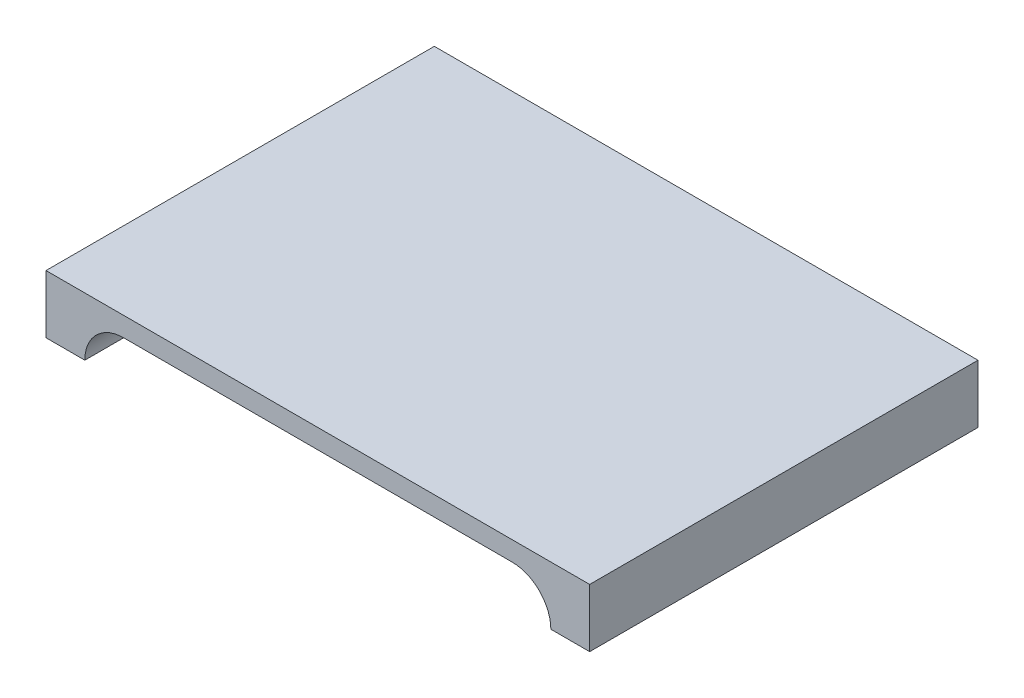
ISO-10303-21;
HEADER;
FILE_DESCRIPTION(('STEP AP214'),'2;1');
FILE_NAME('part.step','',(''),(''),'','','');
FILE_SCHEMA(('AUTOMOTIVE_DESIGN { 1 0 10303 214 1 1 1 1 }'));
ENDSEC;
DATA;
#1=APPLICATION_CONTEXT('core data for automotive mechanical design processes');
#2=APPLICATION_PROTOCOL_DEFINITION('international standard','automotive_design',2000,#1);
#3=PRODUCT_CONTEXT('',#1,'mechanical');
#4=PRODUCT('Part','Part','',(#3));
#5=PRODUCT_RELATED_PRODUCT_CATEGORY('part','',(#4));
#6=PRODUCT_DEFINITION_FORMATION('','',#4);
#7=PRODUCT_DEFINITION_CONTEXT('part definition',#1,'design');
#8=PRODUCT_DEFINITION('design','',#6,#7);
#9=PRODUCT_DEFINITION_SHAPE('','',#8);
#10=(LENGTH_UNIT() NAMED_UNIT(*) SI_UNIT(.MILLI.,.METRE.));
#11=(NAMED_UNIT(*) PLANE_ANGLE_UNIT() SI_UNIT($,.RADIAN.));
#12=(NAMED_UNIT(*) SI_UNIT($,.STERADIAN.) SOLID_ANGLE_UNIT());
#13=UNCERTAINTY_MEASURE_WITH_UNIT(LENGTH_MEASURE(1.E-05),#10,'distance_accuracy_value','');
#14=(GEOMETRIC_REPRESENTATION_CONTEXT(3) GLOBAL_UNCERTAINTY_ASSIGNED_CONTEXT((#13)) GLOBAL_UNIT_ASSIGNED_CONTEXT((#10,
#11,#12)) REPRESENTATION_CONTEXT('',''));
#15=CARTESIAN_POINT('',(0.,0.,0.));
#16=DIRECTION('',(0.,0.,1.));
#17=DIRECTION('',(1.,0.,0.));
#18=AXIS2_PLACEMENT_3D('',#15,#16,#17);
#19=CARTESIAN_POINT('',(0.,25.4,0.));
#20=DIRECTION('',(0.,-1.,0.));
#21=DIRECTION('',(0.,0.,-1.));
#22=AXIS2_PLACEMENT_3D('',#19,#20,#21);
#23=PLANE('',#22);
#24=DIRECTION('',(0.,0.,1.));
#25=VECTOR('',#24,1.);
#26=CARTESIAN_POINT('',(355.6,25.4,0.));
#27=LINE('',#26,#25);
#28=CARTESIAN_POINT('',(355.6,25.4,-25.4));
#29=VERTEX_POINT('',#28);
#30=CARTESIAN_POINT('',(355.6,25.4,482.6));
#31=VERTEX_POINT('',#30);
#32=EDGE_CURVE('E162',#29,#31,#27,.T.);
#33=ORIENTED_EDGE('',*,*,#32,.F.);
#34=DIRECTION('',(1.,0.,0.));
#35=VECTOR('',#34,1.);
#36=CARTESIAN_POINT('',(-355.6,25.4,-25.4));
#37=LINE('',#36,#35);
#38=CARTESIAN_POINT('',(-355.6,25.4,-25.4));
#39=VERTEX_POINT('',#38);
#40=EDGE_CURVE('E130',#39,#29,#37,.T.);
#41=ORIENTED_EDGE('',*,*,#40,.F.);
#42=DIRECTION('',(0.,0.,-1.));
#43=VECTOR('',#42,1.);
#44=CARTESIAN_POINT('',(-355.6,25.4,457.2));
#45=LINE('',#44,#43);
#46=CARTESIAN_POINT('',(-355.6,25.4,482.6));
#47=VERTEX_POINT('',#46);
#48=EDGE_CURVE('E158',#47,#39,#45,.T.);
#49=ORIENTED_EDGE('',*,*,#48,.F.);
#50=DIRECTION('',(-1.,0.,0.));
#51=VECTOR('',#50,1.);
#52=CARTESIAN_POINT('',(0.,25.4,482.6));
#53=LINE('',#52,#51);
#54=EDGE_CURVE('E139',#31,#47,#53,.T.);
#55=ORIENTED_EDGE('',*,*,#54,.F.);
#56=EDGE_LOOP('',(#33,#41,#49,#55));
#57=FACE_BOUND('',#56,.T.);
#58=ADVANCED_FACE('F37',(#57),#23,.F.);
#59=CARTESIAN_POINT('',(-254.,-50.8,457.2));
#60=DIRECTION('',(0.,0.,-1.));
#61=DIRECTION('',(-1.,0.,0.));
#62=AXIS2_PLACEMENT_3D('',#59,#60,#61);
#63=CYLINDRICAL_SURFACE('',#62,50.8);
#64=DIRECTION('',(0.,0.,-1.));
#65=VECTOR('',#64,1.);
#66=CARTESIAN_POINT('',(-304.8,-50.8,457.2));
#67=LINE('',#66,#65);
#68=CARTESIAN_POINT('',(-304.8,-50.8,-25.4));
#69=VERTEX_POINT('',#68);
#70=CARTESIAN_POINT('',(-304.8,-50.8,482.6));
#71=VERTEX_POINT('',#70);
#72=EDGE_CURVE('E40',#69,#71,#67,.F.);
#73=ORIENTED_EDGE('',*,*,#72,.F.);
#74=CARTESIAN_POINT('',(-254.,-50.8,-25.4));
#75=DIRECTION('',(0.,0.,1.));
#76=DIRECTION('',(-1.,0.,0.));
#77=AXIS2_PLACEMENT_3D('',#74,#75,#76);
#78=CIRCLE('',#77,50.8);
#79=CARTESIAN_POINT('',(-254.,0.,-25.4));
#80=VERTEX_POINT('',#79);
#81=EDGE_CURVE('E115',#80,#69,#78,.T.);
#82=ORIENTED_EDGE('',*,*,#81,.F.);
#83=DIRECTION('',(0.,0.,-1.));
#84=VECTOR('',#83,1.);
#85=CARTESIAN_POINT('',(-254.,0.,457.2));
#86=LINE('',#85,#84);
#87=CARTESIAN_POINT('',(-254.,0.,482.6));
#88=VERTEX_POINT('',#87);
#89=EDGE_CURVE('E45',#88,#80,#86,.T.);
#90=ORIENTED_EDGE('',*,*,#89,.F.);
#91=CARTESIAN_POINT('',(-254.,-50.8,482.6));
#92=DIRECTION('',(0.,0.,1.));
#93=DIRECTION('',(1.,0.,0.));
#94=AXIS2_PLACEMENT_3D('',#91,#92,#93);
#95=CIRCLE('',#94,50.8);
#96=EDGE_CURVE('E149',#71,#88,#95,.F.);
#97=ORIENTED_EDGE('',*,*,#96,.F.);
#98=EDGE_LOOP('',(#73,#82,#90,#97));
#99=FACE_BOUND('',#98,.T.);
#100=ADVANCED_FACE('F174',(#99),#63,.F.);
#101=CARTESIAN_POINT('',(0.,0.,457.2));
#102=DIRECTION('',(0.,1.,0.));
#103=DIRECTION('',(0.,0.,1.));
#104=AXIS2_PLACEMENT_3D('',#101,#102,#103);
#105=PLANE('',#104);
#106=ORIENTED_EDGE('',*,*,#89,.T.);
#107=DIRECTION('',(-1.,0.,0.));
#108=VECTOR('',#107,1.);
#109=CARTESIAN_POINT('',(254.,0.,-25.4));
#110=LINE('',#109,#108);
#111=CARTESIAN_POINT('',(254.,0.,-25.4));
#112=VERTEX_POINT('',#111);
#113=EDGE_CURVE('E110',#112,#80,#110,.T.);
#114=ORIENTED_EDGE('',*,*,#113,.F.);
#115=DIRECTION('',(0.,0.,-1.));
#116=VECTOR('',#115,1.);
#117=CARTESIAN_POINT('',(254.,0.,457.2));
#118=LINE('',#117,#116);
#119=CARTESIAN_POINT('',(254.,0.,482.6));
#120=VERTEX_POINT('',#119);
#121=EDGE_CURVE('E11',#120,#112,#118,.T.);
#122=ORIENTED_EDGE('',*,*,#121,.F.);
#123=DIRECTION('',(1.,0.,0.));
#124=VECTOR('',#123,1.);
#125=CARTESIAN_POINT('',(0.,0.,482.6));
#126=LINE('',#125,#124);
#127=EDGE_CURVE('E152',#88,#120,#126,.T.);
#128=ORIENTED_EDGE('',*,*,#127,.F.);
#129=EDGE_LOOP('',(#106,#114,#122,#128));
#130=FACE_BOUND('',#129,.T.);
#131=ADVANCED_FACE('F111',(#130),#105,.F.);
#132=CARTESIAN_POINT('',(254.,-50.8,457.2));
#133=DIRECTION('',(0.,0.,-1.));
#134=DIRECTION('',(-1.,0.,0.));
#135=AXIS2_PLACEMENT_3D('',#132,#133,#134);
#136=CYLINDRICAL_SURFACE('',#135,50.8);
#137=ORIENTED_EDGE('',*,*,#121,.T.);
#138=CARTESIAN_POINT('',(254.,-50.8,-25.4));
#139=DIRECTION('',(0.,0.,1.));
#140=DIRECTION('',(-1.,0.,0.));
#141=AXIS2_PLACEMENT_3D('',#138,#139,#140);
#142=CIRCLE('',#141,50.8);
#143=CARTESIAN_POINT('',(304.8,-50.8,-25.4));
#144=VERTEX_POINT('',#143);
#145=EDGE_CURVE('E104',#144,#112,#142,.T.);
#146=ORIENTED_EDGE('',*,*,#145,.F.);
#147=DIRECTION('',(0.,0.,-1.));
#148=VECTOR('',#147,1.);
#149=CARTESIAN_POINT('',(304.8,-50.8,457.2));
#150=LINE('',#149,#148);
#151=CARTESIAN_POINT('',(304.8,-50.8,482.6));
#152=VERTEX_POINT('',#151);
#153=EDGE_CURVE('E61',#152,#144,#150,.T.);
#154=ORIENTED_EDGE('',*,*,#153,.F.);
#155=CARTESIAN_POINT('',(254.,-50.8,482.6));
#156=DIRECTION('',(0.,0.,1.));
#157=DIRECTION('',(1.,0.,0.));
#158=AXIS2_PLACEMENT_3D('',#155,#156,#157);
#159=CIRCLE('',#158,50.8);
#160=EDGE_CURVE('E105',#120,#152,#159,.F.);
#161=ORIENTED_EDGE('',*,*,#160,.F.);
#162=EDGE_LOOP('',(#137,#146,#154,#161));
#163=FACE_BOUND('',#162,.T.);
#164=ADVANCED_FACE('F102',(#163),#136,.F.);
#165=CARTESIAN_POINT('',(355.6,-50.8,457.2));
#166=DIRECTION('',(0.,1.,0.));
#167=DIRECTION('',(0.,0.,1.));
#168=AXIS2_PLACEMENT_3D('',#165,#166,#167);
#169=PLANE('',#168);
#170=ORIENTED_EDGE('',*,*,#153,.T.);
#171=DIRECTION('',(-1.,0.,0.));
#172=VECTOR('',#171,1.);
#173=CARTESIAN_POINT('',(355.6,-50.8,-25.4));
#174=LINE('',#173,#172);
#175=CARTESIAN_POINT('',(355.6,-50.8,-25.4));
#176=VERTEX_POINT('',#175);
#177=EDGE_CURVE('E120',#176,#144,#174,.T.);
#178=ORIENTED_EDGE('',*,*,#177,.F.);
#179=DIRECTION('',(0.,0.,-1.));
#180=VECTOR('',#179,1.);
#181=CARTESIAN_POINT('',(355.6,-50.8,457.2));
#182=LINE('',#181,#180);
#183=CARTESIAN_POINT('',(355.6,-50.8,482.6));
#184=VERTEX_POINT('',#183);
#185=EDGE_CURVE('E53',#184,#176,#182,.T.);
#186=ORIENTED_EDGE('',*,*,#185,.F.);
#187=DIRECTION('',(1.,0.,0.));
#188=VECTOR('',#187,1.);
#189=CARTESIAN_POINT('',(0.,-50.8,482.6));
#190=LINE('',#189,#188);
#191=EDGE_CURVE('E156',#152,#184,#190,.T.);
#192=ORIENTED_EDGE('',*,*,#191,.F.);
#193=EDGE_LOOP('',(#170,#178,#186,#192));
#194=FACE_BOUND('',#193,.T.);
#195=ADVANCED_FACE('F185',(#194),#169,.F.);
#196=CARTESIAN_POINT('',(355.6,0.,0.));
#197=DIRECTION('',(1.,0.,0.));
#198=DIRECTION('',(0.,0.,-1.));
#199=AXIS2_PLACEMENT_3D('',#196,#197,#198);
#200=PLANE('',#199);
#201=ORIENTED_EDGE('',*,*,#32,.T.);
#202=DIRECTION('',(0.,1.,0.));
#203=VECTOR('',#202,1.);
#204=CARTESIAN_POINT('',(355.6,0.,482.6));
#205=LINE('',#204,#203);
#206=EDGE_CURVE('E136',#184,#31,#205,.T.);
#207=ORIENTED_EDGE('',*,*,#206,.F.);
#208=ORIENTED_EDGE('',*,*,#185,.T.);
#209=DIRECTION('',(0.,-1.,0.));
#210=VECTOR('',#209,1.);
#211=CARTESIAN_POINT('',(355.6,25.4,-25.4));
#212=LINE('',#211,#210);
#213=EDGE_CURVE('E133',#29,#176,#212,.T.);
#214=ORIENTED_EDGE('',*,*,#213,.F.);
#215=EDGE_LOOP('',(#201,#207,#208,#214));
#216=FACE_BOUND('',#215,.T.);
#217=ADVANCED_FACE('F183',(#216),#200,.T.);
#218=CARTESIAN_POINT('',(-355.6,-50.8,0.));
#219=DIRECTION('',(0.,1.,0.));
#220=DIRECTION('',(0.,0.,1.));
#221=AXIS2_PLACEMENT_3D('',#218,#219,#220);
#222=PLANE('',#221);
#223=ORIENTED_EDGE('',*,*,#72,.T.);
#224=DIRECTION('',(1.,0.,0.));
#225=VECTOR('',#224,1.);
#226=CARTESIAN_POINT('',(0.,-50.8,482.6));
#227=LINE('',#226,#225);
#228=CARTESIAN_POINT('',(-355.6,-50.8,482.6));
#229=VERTEX_POINT('',#228);
#230=EDGE_CURVE('E146',#229,#71,#227,.T.);
#231=ORIENTED_EDGE('',*,*,#230,.F.);
#232=DIRECTION('',(0.,0.,1.));
#233=VECTOR('',#232,1.);
#234=CARTESIAN_POINT('',(-355.6,-50.8,0.));
#235=LINE('',#234,#233);
#236=CARTESIAN_POINT('',(-355.6,-50.8,-25.4));
#237=VERTEX_POINT('',#236);
#238=EDGE_CURVE('E160',#237,#229,#235,.T.);
#239=ORIENTED_EDGE('',*,*,#238,.F.);
#240=DIRECTION('',(-1.,0.,0.));
#241=VECTOR('',#240,1.);
#242=CARTESIAN_POINT('',(-304.8,-50.8,-25.4));
#243=LINE('',#242,#241);
#244=EDGE_CURVE('E124',#69,#237,#243,.T.);
#245=ORIENTED_EDGE('',*,*,#244,.F.);
#246=EDGE_LOOP('',(#223,#231,#239,#245));
#247=FACE_BOUND('',#246,.T.);
#248=ADVANCED_FACE('F168',(#247),#222,.F.);
#249=CARTESIAN_POINT('',(-355.6,0.,0.));
#250=DIRECTION('',(-1.,0.,0.));
#251=DIRECTION('',(0.,0.,1.));
#252=AXIS2_PLACEMENT_3D('',#249,#250,#251);
#253=PLANE('',#252);
#254=ORIENTED_EDGE('',*,*,#48,.T.);
#255=DIRECTION('',(0.,1.,0.));
#256=VECTOR('',#255,1.);
#257=CARTESIAN_POINT('',(-355.6,-50.8,-25.4));
#258=LINE('',#257,#256);
#259=EDGE_CURVE('E127',#237,#39,#258,.T.);
#260=ORIENTED_EDGE('',*,*,#259,.F.);
#261=ORIENTED_EDGE('',*,*,#238,.T.);
#262=DIRECTION('',(0.,-1.,0.));
#263=VECTOR('',#262,1.);
#264=CARTESIAN_POINT('',(-355.6,0.,482.6));
#265=LINE('',#264,#263);
#266=EDGE_CURVE('E143',#47,#229,#265,.T.);
#267=ORIENTED_EDGE('',*,*,#266,.F.);
#268=EDGE_LOOP('',(#254,#260,#261,#267));
#269=FACE_BOUND('',#268,.T.);
#270=ADVANCED_FACE('F178',(#269),#253,.T.);
#271=CARTESIAN_POINT('',(0.,0.,482.6));
#272=DIRECTION('',(0.,0.,1.));
#273=DIRECTION('',(1.,0.,0.));
#274=AXIS2_PLACEMENT_3D('',#271,#272,#273);
#275=PLANE('',#274);
#276=ORIENTED_EDGE('',*,*,#206,.T.);
#277=ORIENTED_EDGE('',*,*,#54,.T.);
#278=ORIENTED_EDGE('',*,*,#266,.T.);
#279=ORIENTED_EDGE('',*,*,#230,.T.);
#280=ORIENTED_EDGE('',*,*,#96,.T.);
#281=ORIENTED_EDGE('',*,*,#127,.T.);
#282=ORIENTED_EDGE('',*,*,#160,.T.);
#283=ORIENTED_EDGE('',*,*,#191,.T.);
#284=EDGE_LOOP('',(#276,#277,#278,#279,#280,#281,#282,#283));
#285=FACE_BOUND('',#284,.T.);
#286=ADVANCED_FACE('F172',(#285),#275,.T.);
#287=CARTESIAN_POINT('',(254.,-50.8,-25.4));
#288=DIRECTION('',(0.,0.,-1.));
#289=DIRECTION('',(-1.,0.,0.));
#290=AXIS2_PLACEMENT_3D('',#287,#288,#289);
#291=PLANE('',#290);
#292=ORIENTED_EDGE('',*,*,#145,.T.);
#293=ORIENTED_EDGE('',*,*,#113,.T.);
#294=ORIENTED_EDGE('',*,*,#81,.T.);
#295=ORIENTED_EDGE('',*,*,#244,.T.);
#296=ORIENTED_EDGE('',*,*,#259,.T.);
#297=ORIENTED_EDGE('',*,*,#40,.T.);
#298=ORIENTED_EDGE('',*,*,#213,.T.);
#299=ORIENTED_EDGE('',*,*,#177,.T.);
#300=EDGE_LOOP('',(#292,#293,#294,#295,#296,#297,#298,#299));
#301=FACE_BOUND('',#300,.T.);
#302=ADVANCED_FACE('F118',(#301),#291,.T.);
#303=CLOSED_SHELL('',(#58,#100,#131,#164,#195,#217,#248,#270,#286,#302));
#304=MANIFOLD_SOLID_BREP('B2',#303);
#305=ADVANCED_BREP_SHAPE_REPRESENTATION('',(#18,#304),#14);
#306=SHAPE_DEFINITION_REPRESENTATION(#9,#305);
ENDSEC;
END-ISO-10303-21;
